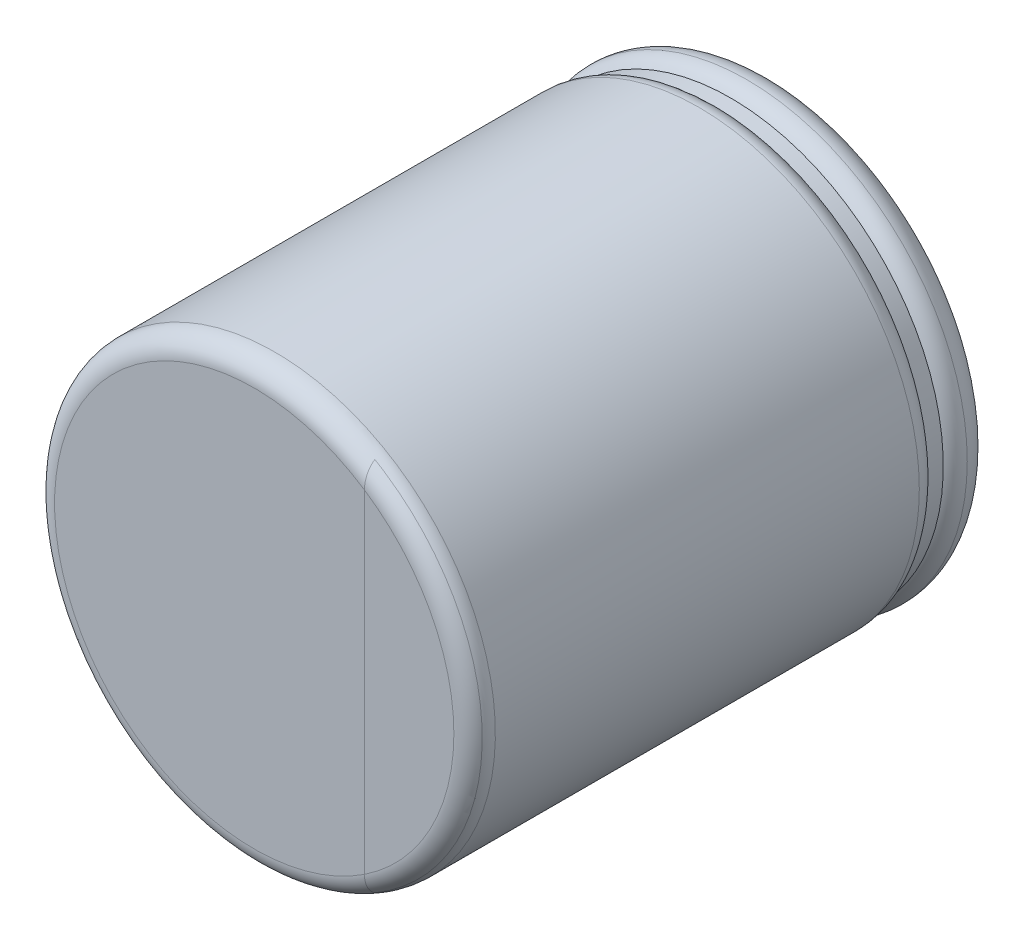
ISO-10303-21;
HEADER;
FILE_DESCRIPTION(('STEP AP214'),'2;1');
FILE_NAME('part.step','',(''),(''),'','','');
FILE_SCHEMA(('AUTOMOTIVE_DESIGN { 1 0 10303 214 1 1 1 1 }'));
ENDSEC;
DATA;
#1=APPLICATION_CONTEXT('core data for automotive mechanical design processes');
#2=APPLICATION_PROTOCOL_DEFINITION('international standard','automotive_design',2000,#1);
#3=PRODUCT_CONTEXT('',#1,'mechanical');
#4=PRODUCT('Part','Part','',(#3));
#5=PRODUCT_RELATED_PRODUCT_CATEGORY('part','',(#4));
#6=PRODUCT_DEFINITION_FORMATION('','',#4);
#7=PRODUCT_DEFINITION_CONTEXT('part definition',#1,'design');
#8=PRODUCT_DEFINITION('design','',#6,#7);
#9=PRODUCT_DEFINITION_SHAPE('','',#8);
#10=(LENGTH_UNIT() NAMED_UNIT(*) SI_UNIT(.MILLI.,.METRE.));
#11=(NAMED_UNIT(*) PLANE_ANGLE_UNIT() SI_UNIT($,.RADIAN.));
#12=(NAMED_UNIT(*) SI_UNIT($,.STERADIAN.) SOLID_ANGLE_UNIT());
#13=UNCERTAINTY_MEASURE_WITH_UNIT(LENGTH_MEASURE(1.E-05),#10,'distance_accuracy_value','');
#14=(GEOMETRIC_REPRESENTATION_CONTEXT(3) GLOBAL_UNCERTAINTY_ASSIGNED_CONTEXT((#13)) GLOBAL_UNIT_ASSIGNED_CONTEXT((#10,
#11,#12)) REPRESENTATION_CONTEXT('',''));
#15=CARTESIAN_POINT('',(0.,0.,0.));
#16=DIRECTION('',(0.,0.,1.));
#17=DIRECTION('',(1.,0.,0.));
#18=AXIS2_PLACEMENT_3D('',#15,#16,#17);
#19=CARTESIAN_POINT('',(3.45,0.,10.1));
#20=DIRECTION('',(0.,0.,-1.));
#21=DIRECTION('',(0.707106781186548,0.707106781186548,0.));
#22=AXIS2_PLACEMENT_3D('',#19,#20,#21);
#23=TOROIDAL_SURFACE('',#22,3.85,0.4);
#24=CARTESIAN_POINT('',(3.45,0.,10.3));
#25=DIRECTION('',(0.,0.,-1.));
#26=DIRECTION('',(0.506385200257319,0.862307386585755,0.));
#27=AXIS2_PLACEMENT_3D('',#24,#25,#26);
#28=CIRCLE('',#27,4.19641016151378);
#29=CARTESIAN_POINT('',(5.57499999999509,3.61859547942336,10.2999999999946));
#30=VERTEX_POINT('',#29);
#31=CARTESIAN_POINT('',(5.57499999999509,-3.61859547942336,10.2999999999946));
#32=VERTEX_POINT('',#31);
#33=EDGE_CURVE('E11',#30,#32,#28,.T.);
#34=ORIENTED_EDGE('',*,*,#33,.T.);
#35=CARTESIAN_POINT('',(5.57500000000001,-3.2104322138927,10.5));
#36=CARTESIAN_POINT('',(5.57500003175159,-3.2162731729262,10.5000000154762));
#37=CARTESIAN_POINT('',(5.57500253964753,-3.22211414165059,10.499911036605));
#38=CARTESIAN_POINT('',(5.57501081072947,-3.23369327100059,10.4995569994696));
#39=CARTESIAN_POINT('',(5.57501651895613,-3.23943152238699,10.4992949009997));
#40=CARTESIAN_POINT('',(5.57502949153868,-3.25079993172167,10.498602496039));
#41=CARTESIAN_POINT('',(5.57503672776484,-3.25643026761771,10.4981751274466));
#42=CARTESIAN_POINT('',(5.57505142867199,-3.26757768057191,10.4971602016003));
#43=CARTESIAN_POINT('',(5.57505888720088,-3.27309502607578,10.4965755559652));
#44=CARTESIAN_POINT('',(5.57507977920431,-3.28932380813211,10.49461105453));
#45=CARTESIAN_POINT('',(5.57509218598043,-3.30000856070524,10.493002300766));
#46=CARTESIAN_POINT('',(5.57510824901721,-3.3208744680984,10.4892288077051));
#47=CARTESIAN_POINT('',(5.57511220944405,-3.33105972332129,10.4870866169233));
#48=CARTESIAN_POINT('',(5.57511024001894,-3.35090265950686,10.4823100991516));
#49=CARTESIAN_POINT('',(5.57510468275817,-3.36056561635788,10.4796977361664));
#50=CARTESIAN_POINT('',(5.57508622793099,-3.37934497623679,10.4740435159628));
#51=CARTESIAN_POINT('',(5.57507363240056,-3.3884677942639,10.4710229799296));
#52=CARTESIAN_POINT('',(5.57504616701875,-3.40615373740638,10.4646134065692));
#53=CARTESIAN_POINT('',(5.57503141394787,-3.41472433577298,10.4612449954204));
#54=CARTESIAN_POINT('',(5.57500926796331,-3.43129822120119,10.4541975551227));
#55=CARTESIAN_POINT('',(5.57500158234134,-3.43930995509917,10.4505384572543));
#56=CARTESIAN_POINT('',(5.57499911978055,-3.45180653211689,10.4444155261133));
#57=CARTESIAN_POINT('',(5.57500028127007,-3.45636154423992,10.4420938883274));
#58=CARTESIAN_POINT('',(5.57500303860434,-3.46535146093091,10.4373300288017));
#59=CARTESIAN_POINT('',(5.57500463010668,-3.46978710333378,10.4348892023813));
#60=CARTESIAN_POINT('',(5.57500856642457,-3.4785349400414,10.4298913090856));
#61=CARTESIAN_POINT('',(5.57501090371973,-3.48284791744238,10.4273356126637));
#62=CARTESIAN_POINT('',(5.5750156807802,-3.49134756533358,10.4221125537513));
#63=CARTESIAN_POINT('',(5.57501811931523,-3.49553505985987,10.4194465327693));
#64=CARTESIAN_POINT('',(5.57502281448311,-3.50378097773418,10.4140074100689));
#65=CARTESIAN_POINT('',(5.5750250726687,-3.50784026531621,10.4112356189009));
#66=CARTESIAN_POINT('',(5.57502913208257,-3.51582720262126,10.4055895995267));
#67=CARTESIAN_POINT('',(5.57503093759051,-3.51975575484993,10.4027166483856));
#68=CARTESIAN_POINT('',(5.57503391585977,-3.52747882550513,10.3968729881767));
#69=CARTESIAN_POINT('',(5.57503509467684,-3.53127428285268,10.3939035203458));
#70=CARTESIAN_POINT('',(5.57503671493954,-3.53872894554611,10.3878715371427));
#71=CARTESIAN_POINT('',(5.57503716352664,-3.5423891241038,10.3848102248531));
#72=CARTESIAN_POINT('',(5.57503729293529,-3.54957118640728,10.3785992855127));
#73=CARTESIAN_POINT('',(5.57503698125418,-3.55309407534698,10.3754508211432));
#74=CARTESIAN_POINT('',(5.57503562882767,-3.5599996907032,10.3690703254815));
#75=CARTESIAN_POINT('',(5.57503459525088,-3.56338345177684,10.3658394143042));
#76=CARTESIAN_POINT('',(5.57503190384308,-3.57000911756599,10.3592987802732));
#77=CARTESIAN_POINT('',(5.57503025219652,-3.57325208367735,10.3559901329067));
#78=CARTESIAN_POINT('',(5.57502649220229,-3.57959463822234,10.3492987824371));
#79=CARTESIAN_POINT('',(5.57502438843743,-3.58269531185911,10.3459171082474));
#80=CARTESIAN_POINT('',(5.57501995071672,-3.5887519310056,10.3390844518892));
#81=CARTESIAN_POINT('',(5.57501761917174,-3.59170898238928,10.3356344502707));
#82=CARTESIAN_POINT('',(5.57501300980818,-3.59747717539902,10.3286698786154));
#83=CARTESIAN_POINT('',(5.57501073168923,-3.60028944023366,10.3251562390696));
#84=CARTESIAN_POINT('',(5.57500656079306,-3.60576704557286,10.318069091345));
#85=CARTESIAN_POINT('',(5.57500466457884,-3.60843352308588,10.3144964623191));
#86=CARTESIAN_POINT('',(5.5750016573809,-3.6136187022378,10.3072960812029));
#87=CARTESIAN_POINT('',(5.57500053923247,-3.61613855097962,10.3036691549858));
#88=CARTESIAN_POINT('',(5.57499999999019,-3.61859547942549,10.2999999999957));
#89=B_SPLINE_CURVE_WITH_KNOTS('',3,(#35,#36,#37,#38,#39,#40,#41,#42,#43,#44,#45,#46,#47,#48,#49,
#50,#51,#52,#53,#54,#55,#56,#57,#58,#59,#60,#61,#62,#63,#64,#65,#66,#67,#68,#69,#70,#71,#72,#73,
#74,#75,#76,#77,#78,#79,#80,#81,#82,#83,#84,#85,#86,#87,#88),.UNSPECIFIED.,.F.,.F.,(4,2,2,2,2,2,
2,2,2,2,2,2,2,2,2,2,2,2,2,2,2,2,2,2,2,2,4),(0.,0.0175221939785436,0.0347523101677725,
0.0516892599538842,0.0683319958330526,0.100727428633977,0.131935052985905,0.161948717611147,
0.190763639544885,0.218376640460471,0.244786394462809,0.26012176572382,0.27530771648672,
0.290345133772248,0.305235023389594,0.319978514387485,0.334576863296463,0.349031458145251,
0.363343822232817,0.377515617636615,0.391548648436158,0.405444863629905,0.419206359722177,
0.432835382955745,0.446334331164649,0.459705755220935,0.472952360048409),.UNSPECIFIED.);
#90=CARTESIAN_POINT('',(5.575,-3.2104322138927,10.5));
#91=VERTEX_POINT('',#90);
#92=EDGE_CURVE('E78',#91,#32,#89,.T.);
#93=ORIENTED_EDGE('',*,*,#92,.F.);
#94=CARTESIAN_POINT('',(3.45,0.,10.5));
#95=DIRECTION('',(0.,0.,-1.));
#96=DIRECTION('',(0.551948051948052,-0.833878497114988,0.));
#97=AXIS2_PLACEMENT_3D('',#94,#95,#96);
#98=CIRCLE('',#97,3.85);
#99=CARTESIAN_POINT('',(5.575,3.2104322138927,10.5));
#100=VERTEX_POINT('',#99);
#101=EDGE_CURVE('E28',#91,#100,#98,.T.);
#102=ORIENTED_EDGE('',*,*,#101,.T.);
#103=CARTESIAN_POINT('',(5.57500000000001,3.21043221389269,10.5));
#104=CARTESIAN_POINT('',(5.5750000317516,3.21627317292573,10.5000000154762));
#105=CARTESIAN_POINT('',(5.57500253964754,3.22211414164966,10.499911036605));
#106=CARTESIAN_POINT('',(5.57501081072949,3.2336932709988,10.4995569994697));
#107=CARTESIAN_POINT('',(5.57501651895616,3.2394315223848,10.4992949009998));
#108=CARTESIAN_POINT('',(5.57502949153873,3.25079993171874,10.4986024960392));
#109=CARTESIAN_POINT('',(5.5750367277649,3.25643026761444,10.4981751274468));
#110=CARTESIAN_POINT('',(5.57505142867207,3.26757768056803,10.4971602016007));
#111=CARTESIAN_POINT('',(5.57505888720097,3.27309502607163,10.4965755559657));
#112=CARTESIAN_POINT('',(5.57507977920444,3.28932380812732,10.4946110545306));
#113=CARTESIAN_POINT('',(5.5750921859806,3.30000856070009,10.4930023007668));
#114=CARTESIAN_POINT('',(5.57510824901745,3.3208744680928,10.4892288077062));
#115=CARTESIAN_POINT('',(5.57511220944432,3.33105972331558,10.4870866169245));
#116=CARTESIAN_POINT('',(5.57511024001928,3.3509026595012,10.482310099153));
#117=CARTESIAN_POINT('',(5.57510468275853,3.36056561635236,10.4796977361679));
#118=CARTESIAN_POINT('',(5.57508622793138,3.3793449762318,10.4740435159644));
#119=CARTESIAN_POINT('',(5.57507363240095,3.38846779425929,10.4710229799311));
#120=CARTESIAN_POINT('',(5.57504616701911,3.40615373740276,10.4646134065705));
#121=CARTESIAN_POINT('',(5.5750314139482,3.41472433576996,10.4612449954216));
#122=CARTESIAN_POINT('',(5.57500926796353,3.4312982211996,10.4541975551233));
#123=CARTESIAN_POINT('',(5.57500158234146,3.43930995509838,10.4505384572547));
#124=CARTESIAN_POINT('',(5.57499911978051,3.45180653211664,10.4444155261134));
#125=CARTESIAN_POINT('',(5.57500028126996,3.45636154423941,10.4420938883277));
#126=CARTESIAN_POINT('',(5.57500303860412,3.46535146092993,10.4373300288023));
#127=CARTESIAN_POINT('',(5.57500463010641,3.46978710333258,10.4348892023821));
#128=CARTESIAN_POINT('',(5.57500856642423,3.47853494003981,10.4298913090867));
#129=CARTESIAN_POINT('',(5.57501090371936,3.48284791744061,10.4273356126649));
#130=CARTESIAN_POINT('',(5.57501568077977,3.49134756533151,10.4221125537527));
#131=CARTESIAN_POINT('',(5.57501811931478,3.49553505985766,10.4194465327709));
#132=CARTESIAN_POINT('',(5.57502281448263,3.50378097773174,10.4140074100707));
#133=CARTESIAN_POINT('',(5.57502507266821,3.50784026531367,10.4112356189029));
#134=CARTESIAN_POINT('',(5.57502913208207,3.51582720261857,10.4055895995289));
#135=CARTESIAN_POINT('',(5.57503093759001,3.51975575484718,10.4027166483879));
#136=CARTESIAN_POINT('',(5.57503391585928,3.5274788255023,10.3968729881791));
#137=CARTESIAN_POINT('',(5.57503509467636,3.53127428284983,10.3939035203483));
#138=CARTESIAN_POINT('',(5.57503671493908,3.53872894554324,10.3878715371453));
#139=CARTESIAN_POINT('',(5.5750371635262,3.54238912410095,10.3848102248557));
#140=CARTESIAN_POINT('',(5.57503729293488,3.54957118640447,10.3785992855154));
#141=CARTESIAN_POINT('',(5.57503698125379,3.55309407534421,10.3754508211459));
#142=CARTESIAN_POINT('',(5.57503562882733,3.55999969070053,10.3690703254843));
#143=CARTESIAN_POINT('',(5.57503459525055,3.56338345177425,10.3658394143069));
#144=CARTESIAN_POINT('',(5.57503190384279,3.57000911756355,10.3592987802758));
#145=CARTESIAN_POINT('',(5.57503025219626,3.57325208367501,10.3559901329093));
#146=CARTESIAN_POINT('',(5.57502649220208,3.57959463822021,10.3492987824396));
#147=CARTESIAN_POINT('',(5.57502438843724,3.58269531185709,10.3459171082498));
#148=CARTESIAN_POINT('',(5.57501995071658,3.58875193100384,10.3390844518913));
#149=CARTESIAN_POINT('',(5.57501761917161,3.59170898238766,10.3356344502727));
#150=CARTESIAN_POINT('',(5.5750130098081,3.59747717539769,10.3286698786171));
#151=CARTESIAN_POINT('',(5.57501073168916,3.60028944023247,10.3251562390711));
#152=CARTESIAN_POINT('',(5.57500656079302,3.605767045572,10.3180690913462));
#153=CARTESIAN_POINT('',(5.57500466457881,3.60843352308518,10.31449646232));
#154=CARTESIAN_POINT('',(5.57500165738088,3.61361870223746,10.3072960812034));
#155=CARTESIAN_POINT('',(5.57500053923246,3.61613855097946,10.3036691549861));
#156=CARTESIAN_POINT('',(5.57499999999018,3.61859547942549,10.2999999999957));
#157=B_SPLINE_CURVE_WITH_KNOTS('',3,(#103,#104,#105,#106,#107,#108,#109,#110,#111,#112,#113,
#114,#115,#116,#117,#118,#119,#120,#121,#122,#123,#124,#125,#126,#127,#128,#129,#130,#131,#132,
#133,#134,#135,#136,#137,#138,#139,#140,#141,#142,#143,#144,#145,#146,#147,#148,#149,#150,#151,
#152,#153,#154,#155,#156),.UNSPECIFIED.,.F.,.F.,(4,2,2,2,2,2,2,2,2,2,2,2,2,2,2,2,2,2,2,2,2,2,2,
2,2,2,4),(0.,0.0175221939771553,0.0347523101651786,0.0516892599502671,0.0683319958285964,
0.100727428628398,0.131935052979946,0.161948717605553,0.190763639540406,0.218376640457856,
0.244786394462811,0.260121765722916,0.275307716485031,0.290345133769888,0.305235023386689,
0.31997851438415,0.334576863292821,0.349031458141424,0.363343822228927,0.377515617632783,
0.391548648432509,0.405444863626561,0.419206359719262,0.432835382953386,0.446334331162966,
0.459705755220053,0.472952360048454),.UNSPECIFIED.);
#158=EDGE_CURVE('E77',#100,#30,#157,.T.);
#159=ORIENTED_EDGE('',*,*,#158,.T.);
#160=EDGE_LOOP('',(#34,#93,#102,#159));
#161=FACE_BOUND('',#160,.T.);
#162=CARTESIAN_POINT('',(3.45,0.,10.1));
#163=DIRECTION('',(0.,0.,-1.));
#164=DIRECTION('',(-1.,0.,0.));
#165=AXIS2_PLACEMENT_3D('',#162,#163,#164);
#166=CIRCLE('',#165,4.25);
#167=CARTESIAN_POINT('',(-0.8,0.,10.1));
#168=VERTEX_POINT('',#167);
#169=EDGE_CURVE('E88',#168,#168,#166,.T.);
#170=ORIENTED_EDGE('',*,*,#169,.F.);
#171=EDGE_LOOP('',(#170));
#172=FACE_BOUND('',#171,.T.);
#173=ADVANCED_FACE('F16',(#161,#172),#23,.T.);
#174=CARTESIAN_POINT('',(3.45,0.,10.1));
#175=DIRECTION('',(0.,0.,-1.));
#176=DIRECTION('',(0.707106781186548,0.707106781186548,0.));
#177=AXIS2_PLACEMENT_3D('',#174,#175,#176);
#178=TOROIDAL_SURFACE('',#177,3.85,0.4);
#179=ORIENTED_EDGE('',*,*,#33,.F.);
#180=ORIENTED_EDGE('',*,*,#158,.F.);
#181=CARTESIAN_POINT('',(3.45,0.,10.5));
#182=DIRECTION('',(0.,0.,-1.));
#183=DIRECTION('',(0.551948051948051,0.833878497114988,0.));
#184=AXIS2_PLACEMENT_3D('',#181,#182,#183);
#185=CIRCLE('',#184,3.85);
#186=EDGE_CURVE('E74',#100,#91,#185,.T.);
#187=ORIENTED_EDGE('',*,*,#186,.T.);
#188=ORIENTED_EDGE('',*,*,#92,.T.);
#189=EDGE_LOOP('',(#179,#180,#187,#188));
#190=FACE_BOUND('',#189,.T.);
#191=ADVANCED_FACE('F97',(#190),#178,.T.);
#192=CARTESIAN_POINT('',(3.45,0.,10.5));
#193=DIRECTION('',(0.,0.,1.));
#194=DIRECTION('',(0.707106781186548,0.707106781186548,0.));
#195=AXIS2_PLACEMENT_3D('',#192,#193,#194);
#196=PLANE('',#195);
#197=DIRECTION('',(0.,-1.,0.));
#198=VECTOR('',#197,1.);
#199=CARTESIAN_POINT('',(5.575,3.2104322138927,10.5));
#200=LINE('',#199,#198);
#201=EDGE_CURVE('E85',#100,#91,#200,.T.);
#202=ORIENTED_EDGE('',*,*,#201,.T.);
#203=ORIENTED_EDGE('',*,*,#186,.F.);
#204=EDGE_LOOP('',(#202,#203));
#205=FACE_BOUND('',#204,.T.);
#206=ADVANCED_FACE('F107',(#205),#196,.T.);
#207=CARTESIAN_POINT('',(3.45,0.,10.5));
#208=DIRECTION('',(0.,0.,1.));
#209=DIRECTION('',(0.707106781186548,0.707106781186548,0.));
#210=AXIS2_PLACEMENT_3D('',#207,#208,#209);
#211=PLANE('',#210);
#212=ORIENTED_EDGE('',*,*,#201,.F.);
#213=ORIENTED_EDGE('',*,*,#101,.F.);
#214=EDGE_LOOP('',(#212,#213));
#215=FACE_BOUND('',#214,.T.);
#216=ADVANCED_FACE('F112',(#215),#211,.T.);
#217=CARTESIAN_POINT('',(3.45,0.,10.1));
#218=DIRECTION('',(0.,0.,-1.));
#219=DIRECTION('',(-1.,0.,0.));
#220=AXIS2_PLACEMENT_3D('',#217,#218,#219);
#221=CYLINDRICAL_SURFACE('',#220,4.25);
#222=ORIENTED_EDGE('',*,*,#169,.T.);
#223=EDGE_LOOP('',(#222));
#224=FACE_BOUND('',#223,.T.);
#225=CARTESIAN_POINT('',(3.45,0.,1.92449979983984));
#226=DIRECTION('',(0.,0.,-1.));
#227=DIRECTION('',(-1.,0.,0.));
#228=AXIS2_PLACEMENT_3D('',#225,#226,#227);
#229=CIRCLE('',#228,4.25);
#230=CARTESIAN_POINT('',(-0.8,0.,1.92449979983984));
#231=VERTEX_POINT('',#230);
#232=EDGE_CURVE('E142',#231,#231,#229,.T.);
#233=ORIENTED_EDGE('',*,*,#232,.F.);
#234=EDGE_LOOP('',(#233));
#235=FACE_BOUND('',#234,.T.);
#236=ADVANCED_FACE('F116',(#224,#235),#221,.T.);
#237=CARTESIAN_POINT('',(3.45,0.,1.92449979983984));
#238=DIRECTION('',(0.,0.,-1.));
#239=DIRECTION('',(0.707106781186548,0.707106781186548,0.));
#240=AXIS2_PLACEMENT_3D('',#237,#238,#239);
#241=TOROIDAL_SURFACE('',#240,3.85,0.4);
#242=CARTESIAN_POINT('',(3.45,0.,1.61224989991992));
#243=DIRECTION('',(0.,0.,-1.));
#244=DIRECTION('',(-1.,0.,0.));
#245=AXIS2_PLACEMENT_3D('',#242,#243,#244);
#246=CIRCLE('',#245,4.1);
#247=CARTESIAN_POINT('',(-0.65,0.,1.61224989991992));
#248=VERTEX_POINT('',#247);
#249=EDGE_CURVE('E145',#248,#248,#246,.T.);
#250=ORIENTED_EDGE('',*,*,#249,.F.);
#251=EDGE_LOOP('',(#250));
#252=FACE_BOUND('',#251,.T.);
#253=ORIENTED_EDGE('',*,*,#232,.T.);
#254=EDGE_LOOP('',(#253));
#255=FACE_BOUND('',#254,.T.);
#256=ADVANCED_FACE('F120',(#252,#255),#241,.T.);
#257=CARTESIAN_POINT('',(3.45,0.,1.61224989991992));
#258=DIRECTION('',(0.,0.,-1.));
#259=DIRECTION('',(-1.,0.,0.));
#260=AXIS2_PLACEMENT_3D('',#257,#258,#259);
#261=CYLINDRICAL_SURFACE('',#260,4.1);
#262=ORIENTED_EDGE('',*,*,#249,.T.);
#263=EDGE_LOOP('',(#262));
#264=FACE_BOUND('',#263,.T.);
#265=CARTESIAN_POINT('',(3.45,0.,1.31224989991992));
#266=DIRECTION('',(0.,0.,-1.));
#267=DIRECTION('',(-1.,0.,0.));
#268=AXIS2_PLACEMENT_3D('',#265,#266,#267);
#269=CIRCLE('',#268,4.1);
#270=CARTESIAN_POINT('',(-0.65,0.,1.31224989991992));
#271=VERTEX_POINT('',#270);
#272=EDGE_CURVE('E68',#271,#271,#269,.T.);
#273=ORIENTED_EDGE('',*,*,#272,.F.);
#274=EDGE_LOOP('',(#273));
#275=FACE_BOUND('',#274,.T.);
#276=ADVANCED_FACE('F124',(#264,#275),#261,.T.);
#277=CARTESIAN_POINT('',(3.45,0.,1.));
#278=DIRECTION('',(0.,0.,-1.));
#279=DIRECTION('',(0.707106781186548,0.707106781186548,0.));
#280=AXIS2_PLACEMENT_3D('',#277,#278,#279);
#281=TOROIDAL_SURFACE('',#280,3.85,0.4);
#282=ORIENTED_EDGE('',*,*,#272,.T.);
#283=EDGE_LOOP('',(#282));
#284=FACE_BOUND('',#283,.T.);
#285=CARTESIAN_POINT('',(3.45,0.,1.));
#286=DIRECTION('',(0.,0.,-1.));
#287=DIRECTION('',(-1.,0.,0.));
#288=AXIS2_PLACEMENT_3D('',#285,#286,#287);
#289=CIRCLE('',#288,4.25);
#290=CARTESIAN_POINT('',(-0.8,0.,1.));
#291=VERTEX_POINT('',#290);
#292=EDGE_CURVE('E59',#291,#291,#289,.T.);
#293=ORIENTED_EDGE('',*,*,#292,.F.);
#294=EDGE_LOOP('',(#293));
#295=FACE_BOUND('',#294,.T.);
#296=ADVANCED_FACE('F128',(#284,#295),#281,.T.);
#297=CARTESIAN_POINT('',(3.45,0.,1.));
#298=DIRECTION('',(0.,0.,-1.));
#299=DIRECTION('',(0.707106781186548,0.707106781186548,0.));
#300=AXIS2_PLACEMENT_3D('',#297,#298,#299);
#301=TOROIDAL_SURFACE('',#300,3.75,0.5);
#302=CARTESIAN_POINT('',(3.45,0.,0.5));
#303=DIRECTION('',(0.,0.,-1.));
#304=DIRECTION('',(-1.,0.,0.));
#305=AXIS2_PLACEMENT_3D('',#302,#303,#304);
#306=CIRCLE('',#305,3.75);
#307=CARTESIAN_POINT('',(-0.3,0.,0.5));
#308=VERTEX_POINT('',#307);
#309=EDGE_CURVE('E63',#308,#308,#306,.T.);
#310=ORIENTED_EDGE('',*,*,#309,.F.);
#311=EDGE_LOOP('',(#310));
#312=FACE_BOUND('',#311,.T.);
#313=ORIENTED_EDGE('',*,*,#292,.T.);
#314=EDGE_LOOP('',(#313));
#315=FACE_BOUND('',#314,.T.);
#316=ADVANCED_FACE('F64',(#312,#315),#301,.T.);
#317=CARTESIAN_POINT('',(3.45,0.,0.5));
#318=DIRECTION('',(0.,0.,-1.));
#319=DIRECTION('',(0.707106781186548,0.707106781186548,0.));
#320=AXIS2_PLACEMENT_3D('',#317,#318,#319);
#321=PLANE('',#320);
#322=ORIENTED_EDGE('',*,*,#309,.T.);
#323=EDGE_LOOP('',(#322));
#324=FACE_BOUND('',#323,.T.);
#325=ADVANCED_FACE('F18',(#324),#321,.T.);
#326=CLOSED_SHELL('',(#173,#191,#206,#216,#236,#256,#276,#296,#316,#325));
#327=MANIFOLD_SOLID_BREP('B1',#326);
#328=ADVANCED_BREP_SHAPE_REPRESENTATION('',(#18,#327),#14);
#329=SHAPE_DEFINITION_REPRESENTATION(#9,#328);
ENDSEC;
END-ISO-10303-21;
